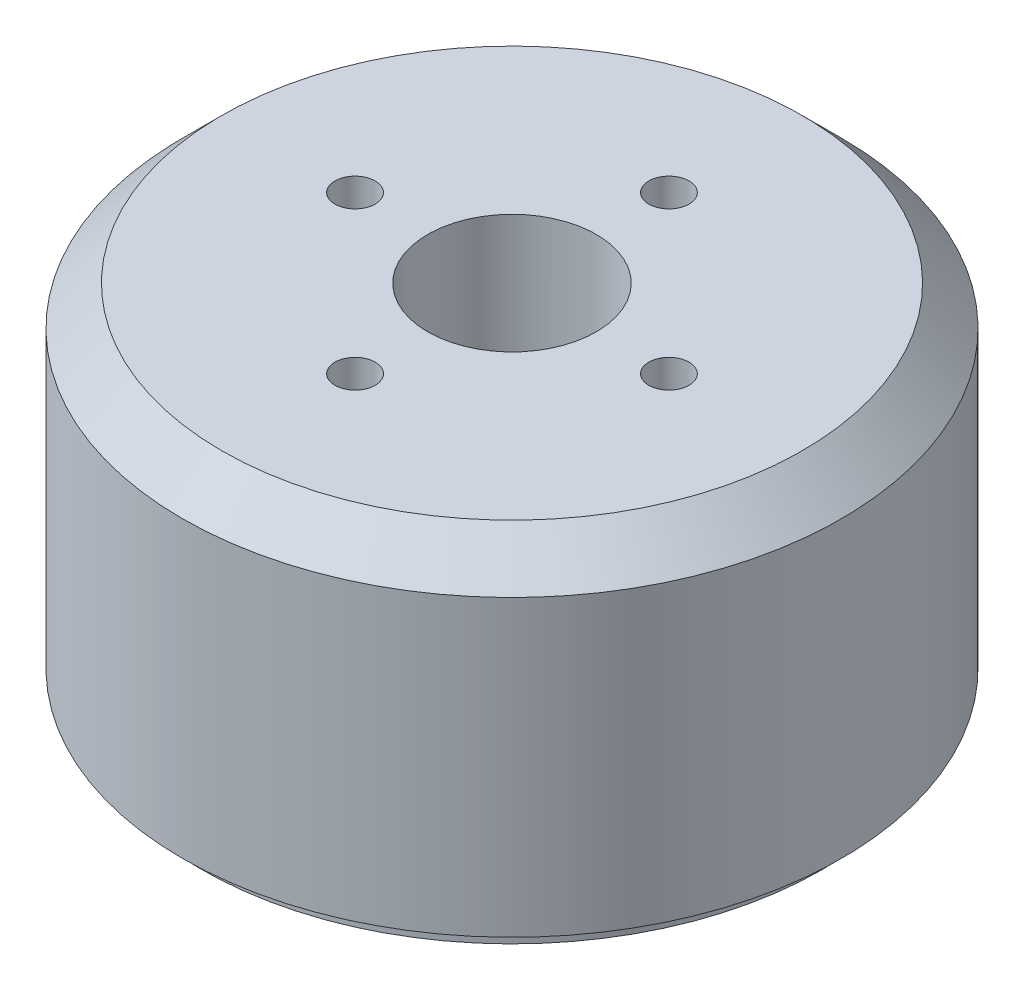
ISO-10303-21;
HEADER;
FILE_DESCRIPTION(('STEP AP214'),'2;1');
FILE_NAME('part.step','',(''),(''),'','','');
FILE_SCHEMA(('AUTOMOTIVE_DESIGN { 1 0 10303 214 1 1 1 1 }'));
ENDSEC;
DATA;
#1=APPLICATION_CONTEXT('core data for automotive mechanical design processes');
#2=APPLICATION_PROTOCOL_DEFINITION('international standard','automotive_design',2000,#1);
#3=PRODUCT_CONTEXT('',#1,'mechanical');
#4=PRODUCT('Part','Part','',(#3));
#5=PRODUCT_RELATED_PRODUCT_CATEGORY('part','',(#4));
#6=PRODUCT_DEFINITION_FORMATION('','',#4);
#7=PRODUCT_DEFINITION_CONTEXT('part definition',#1,'design');
#8=PRODUCT_DEFINITION('design','',#6,#7);
#9=PRODUCT_DEFINITION_SHAPE('','',#8);
#10=(LENGTH_UNIT() NAMED_UNIT(*) SI_UNIT(.MILLI.,.METRE.));
#11=(NAMED_UNIT(*) PLANE_ANGLE_UNIT() SI_UNIT($,.RADIAN.));
#12=(NAMED_UNIT(*) SI_UNIT($,.STERADIAN.) SOLID_ANGLE_UNIT());
#13=UNCERTAINTY_MEASURE_WITH_UNIT(LENGTH_MEASURE(1.E-05),#10,'distance_accuracy_value','');
#14=(GEOMETRIC_REPRESENTATION_CONTEXT(3) GLOBAL_UNCERTAINTY_ASSIGNED_CONTEXT((#13)) GLOBAL_UNIT_ASSIGNED_CONTEXT((#10,
#11,#12)) REPRESENTATION_CONTEXT('',''));
#15=CARTESIAN_POINT('',(0.,0.,0.));
#16=DIRECTION('',(0.,0.,1.));
#17=DIRECTION('',(1.,0.,0.));
#18=AXIS2_PLACEMENT_3D('',#15,#16,#17);
#19=CARTESIAN_POINT('',(0.,0.,0.));
#20=DIRECTION('',(0.,1.,0.));
#21=DIRECTION('',(0.,0.,1.));
#22=AXIS2_PLACEMENT_3D('',#19,#20,#21);
#23=PLANE('',#22);
#24=CARTESIAN_POINT('',(1.13871772702761E-13,0.,11.));
#25=DIRECTION('',(0.,-1.,0.));
#26=DIRECTION('',(0.,0.,-1.));
#27=AXIS2_PLACEMENT_3D('',#24,#25,#26);
#28=CIRCLE('',#27,1.025);
#29=CARTESIAN_POINT('',(1.13871772702761E-13,0.,9.975));
#30=VERTEX_POINT('',#29);
#31=EDGE_CURVE('E100',#30,#30,#28,.T.);
#32=ORIENTED_EDGE('',*,*,#31,.F.);
#33=EDGE_LOOP('',(#32));
#34=FACE_BOUND('',#33,.T.);
#35=CARTESIAN_POINT('',(-11.,0.,0.));
#36=DIRECTION('',(0.,-1.,0.));
#37=DIRECTION('',(0.,0.,-1.));
#38=AXIS2_PLACEMENT_3D('',#35,#36,#37);
#39=CIRCLE('',#38,1.025);
#40=CARTESIAN_POINT('',(-11.,0.,-1.025));
#41=VERTEX_POINT('',#40);
#42=EDGE_CURVE('E99',#41,#41,#39,.T.);
#43=ORIENTED_EDGE('',*,*,#42,.F.);
#44=EDGE_LOOP('',(#43));
#45=FACE_BOUND('',#44,.T.);
#46=CARTESIAN_POINT('',(0.,0.,-11.));
#47=DIRECTION('',(0.,-1.,0.));
#48=DIRECTION('',(0.,0.,-1.));
#49=AXIS2_PLACEMENT_3D('',#46,#47,#48);
#50=CIRCLE('',#49,1.025);
#51=CARTESIAN_POINT('',(0.,0.,-12.025));
#52=VERTEX_POINT('',#51);
#53=EDGE_CURVE('E110',#52,#52,#50,.T.);
#54=ORIENTED_EDGE('',*,*,#53,.F.);
#55=EDGE_LOOP('',(#54));
#56=FACE_BOUND('',#55,.T.);
#57=CARTESIAN_POINT('',(11.,0.,0.));
#58=DIRECTION('',(0.,-1.,0.));
#59=DIRECTION('',(0.,0.,-1.));
#60=AXIS2_PLACEMENT_3D('',#57,#58,#59);
#61=CIRCLE('',#60,1.025);
#62=CARTESIAN_POINT('',(11.,0.,-1.025));
#63=VERTEX_POINT('',#62);
#64=EDGE_CURVE('E116',#63,#63,#61,.T.);
#65=ORIENTED_EDGE('',*,*,#64,.F.);
#66=EDGE_LOOP('',(#65));
#67=FACE_BOUND('',#66,.T.);
#68=CARTESIAN_POINT('',(0.,0.,0.));
#69=DIRECTION('',(0.,1.,0.));
#70=DIRECTION('',(0.,0.,1.));
#71=AXIS2_PLACEMENT_3D('',#68,#69,#70);
#72=CIRCLE('',#71,5.3);
#73=CARTESIAN_POINT('',(0.,0.,5.3));
#74=VERTEX_POINT('',#73);
#75=EDGE_CURVE('E12',#74,#74,#72,.F.);
#76=ORIENTED_EDGE('',*,*,#75,.F.);
#77=EDGE_LOOP('',(#76));
#78=FACE_BOUND('',#77,.T.);
#79=CARTESIAN_POINT('',(0.,0.,0.));
#80=DIRECTION('',(0.,-1.,0.));
#81=DIRECTION('',(1.,0.,0.));
#82=AXIS2_PLACEMENT_3D('',#79,#80,#81);
#83=CIRCLE('',#82,15.8);
#84=CARTESIAN_POINT('',(15.8,0.,0.));
#85=VERTEX_POINT('',#84);
#86=EDGE_CURVE('E122',#85,#85,#83,.T.);
#87=ORIENTED_EDGE('',*,*,#86,.T.);
#88=EDGE_LOOP('',(#87));
#89=FACE_BOUND('',#88,.T.);
#90=ADVANCED_FACE('F56',(#34,#45,#56,#67,#78,#89),#23,.F.);
#91=CARTESIAN_POINT('',(0.,18.,0.));
#92=DIRECTION('',(0.,-1.,0.));
#93=DIRECTION('',(0.,0.,-1.));
#94=AXIS2_PLACEMENT_3D('',#91,#92,#93);
#95=CYLINDRICAL_SURFACE('',#94,16.8);
#96=CARTESIAN_POINT('',(0.,16.,0.));
#97=DIRECTION('',(0.,1.,0.));
#98=DIRECTION('',(0.,0.,1.));
#99=AXIS2_PLACEMENT_3D('',#96,#97,#98);
#100=CIRCLE('',#99,16.8);
#101=CARTESIAN_POINT('',(0.,16.,16.8));
#102=VERTEX_POINT('',#101);
#103=EDGE_CURVE('E64',#102,#102,#100,.F.);
#104=ORIENTED_EDGE('',*,*,#103,.T.);
#105=EDGE_LOOP('',(#104));
#106=FACE_BOUND('',#105,.T.);
#107=CARTESIAN_POINT('',(0.,1.,0.));
#108=DIRECTION('',(0.,-1.,0.));
#109=DIRECTION('',(0.,0.,-1.));
#110=AXIS2_PLACEMENT_3D('',#107,#108,#109);
#111=CIRCLE('',#110,16.8);
#112=CARTESIAN_POINT('',(0.,1.,-16.8));
#113=VERTEX_POINT('',#112);
#114=EDGE_CURVE('E126',#113,#113,#111,.T.);
#115=ORIENTED_EDGE('',*,*,#114,.F.);
#116=EDGE_LOOP('',(#115));
#117=FACE_BOUND('',#116,.T.);
#118=ADVANCED_FACE('F175',(#106,#117),#95,.T.);
#119=CARTESIAN_POINT('',(0.,-2.,0.));
#120=DIRECTION('',(0.,-1.,0.));
#121=DIRECTION('',(0.,0.,-1.));
#122=AXIS2_PLACEMENT_3D('',#119,#120,#121);
#123=PLANE('',#122);
#124=CARTESIAN_POINT('',(0.,-2.,0.));
#125=DIRECTION('',(0.,-1.,0.));
#126=DIRECTION('',(0.,0.,-1.));
#127=AXIS2_PLACEMENT_3D('',#124,#125,#126);
#128=CIRCLE('',#127,4.3);
#129=CARTESIAN_POINT('',(0.,-2.,-4.3));
#130=VERTEX_POINT('',#129);
#131=EDGE_CURVE('E140',#130,#130,#128,.T.);
#132=ORIENTED_EDGE('',*,*,#131,.F.);
#133=EDGE_LOOP('',(#132));
#134=FACE_BOUND('',#133,.T.);
#135=CARTESIAN_POINT('',(0.,-2.,0.));
#136=DIRECTION('',(0.,-1.,0.));
#137=DIRECTION('',(1.,0.,0.));
#138=AXIS2_PLACEMENT_3D('',#135,#136,#137);
#139=CIRCLE('',#138,4.8);
#140=CARTESIAN_POINT('',(4.8,-2.,0.));
#141=VERTEX_POINT('',#140);
#142=EDGE_CURVE('E131',#141,#141,#139,.T.);
#143=ORIENTED_EDGE('',*,*,#142,.T.);
#144=EDGE_LOOP('',(#143));
#145=FACE_BOUND('',#144,.T.);
#146=ADVANCED_FACE('F197',(#134,#145),#123,.T.);
#147=CARTESIAN_POINT('',(0.,-2.,0.));
#148=DIRECTION('',(0.,1.,0.));
#149=DIRECTION('',(0.,0.,1.));
#150=AXIS2_PLACEMENT_3D('',#147,#148,#149);
#151=CYLINDRICAL_SURFACE('',#150,5.3);
#152=ORIENTED_EDGE('',*,*,#75,.T.);
#153=EDGE_LOOP('',(#152));
#154=FACE_BOUND('',#153,.T.);
#155=CARTESIAN_POINT('',(0.,-1.5,0.));
#156=DIRECTION('',(0.,-1.,0.));
#157=DIRECTION('',(0.,0.,-1.));
#158=AXIS2_PLACEMENT_3D('',#155,#156,#157);
#159=CIRCLE('',#158,5.3);
#160=CARTESIAN_POINT('',(0.,-1.5,-5.3));
#161=VERTEX_POINT('',#160);
#162=EDGE_CURVE('E135',#161,#161,#159,.T.);
#163=ORIENTED_EDGE('',*,*,#162,.F.);
#164=EDGE_LOOP('',(#163));
#165=FACE_BOUND('',#164,.T.);
#166=ADVANCED_FACE('F187',(#154,#165),#151,.T.);
#167=CARTESIAN_POINT('',(0.,18.,0.));
#168=DIRECTION('',(0.,1.,0.));
#169=DIRECTION('',(0.,0.,1.));
#170=AXIS2_PLACEMENT_3D('',#167,#168,#169);
#171=PLANE('',#170);
#172=CARTESIAN_POINT('',(8.,18.,0.));
#173=DIRECTION('',(0.,1.,0.));
#174=DIRECTION('',(0.,0.,1.));
#175=AXIS2_PLACEMENT_3D('',#172,#173,#174);
#176=CIRCLE('',#175,1.025);
#177=CARTESIAN_POINT('',(8.,18.,1.02499999999992));
#178=VERTEX_POINT('',#177);
#179=EDGE_CURVE('E143',#178,#178,#176,.T.);
#180=ORIENTED_EDGE('',*,*,#179,.F.);
#181=EDGE_LOOP('',(#180));
#182=FACE_BOUND('',#181,.T.);
#183=CARTESIAN_POINT('',(0.,18.,8.));
#184=DIRECTION('',(0.,1.,0.));
#185=DIRECTION('',(0.,0.,1.));
#186=AXIS2_PLACEMENT_3D('',#183,#184,#185);
#187=CIRCLE('',#186,1.025);
#188=CARTESIAN_POINT('',(0.,18.,9.025));
#189=VERTEX_POINT('',#188);
#190=EDGE_CURVE('E149',#189,#189,#187,.T.);
#191=ORIENTED_EDGE('',*,*,#190,.F.);
#192=EDGE_LOOP('',(#191));
#193=FACE_BOUND('',#192,.T.);
#194=CARTESIAN_POINT('',(-8.,18.,0.));
#195=DIRECTION('',(0.,1.,0.));
#196=DIRECTION('',(0.,0.,1.));
#197=AXIS2_PLACEMENT_3D('',#194,#195,#196);
#198=CIRCLE('',#197,1.025);
#199=CARTESIAN_POINT('',(-8.,18.,1.02500000000003));
#200=VERTEX_POINT('',#199);
#201=EDGE_CURVE('E155',#200,#200,#198,.T.);
#202=ORIENTED_EDGE('',*,*,#201,.F.);
#203=EDGE_LOOP('',(#202));
#204=FACE_BOUND('',#203,.T.);
#205=CARTESIAN_POINT('',(0.,18.,-8.));
#206=DIRECTION('',(0.,1.,0.));
#207=DIRECTION('',(0.,0.,1.));
#208=AXIS2_PLACEMENT_3D('',#205,#206,#207);
#209=CIRCLE('',#208,1.025);
#210=CARTESIAN_POINT('',(0.,18.,-6.975));
#211=VERTEX_POINT('',#210);
#212=EDGE_CURVE('E161',#211,#211,#209,.T.);
#213=ORIENTED_EDGE('',*,*,#212,.F.);
#214=EDGE_LOOP('',(#213));
#215=FACE_BOUND('',#214,.T.);
#216=CARTESIAN_POINT('',(0.,18.,0.));
#217=DIRECTION('',(0.,1.,0.));
#218=DIRECTION('',(0.,0.,1.));
#219=AXIS2_PLACEMENT_3D('',#216,#217,#218);
#220=CIRCLE('',#219,14.8);
#221=CARTESIAN_POINT('',(0.,18.,14.8));
#222=VERTEX_POINT('',#221);
#223=EDGE_CURVE('E170',#222,#222,#220,.T.);
#224=ORIENTED_EDGE('',*,*,#223,.T.);
#225=EDGE_LOOP('',(#224));
#226=FACE_BOUND('',#225,.T.);
#227=CARTESIAN_POINT('',(0.,18.,0.));
#228=DIRECTION('',(0.,1.,0.));
#229=DIRECTION('',(0.,0.,1.));
#230=AXIS2_PLACEMENT_3D('',#227,#228,#229);
#231=CIRCLE('',#230,4.3);
#232=CARTESIAN_POINT('',(0.,18.,4.3));
#233=VERTEX_POINT('',#232);
#234=EDGE_CURVE('E167',#233,#233,#231,.T.);
#235=ORIENTED_EDGE('',*,*,#234,.F.);
#236=EDGE_LOOP('',(#235));
#237=FACE_BOUND('',#236,.T.);
#238=ADVANCED_FACE('F184',(#182,#193,#204,#215,#226,#237),#171,.T.);
#239=CARTESIAN_POINT('',(0.,0.,0.));
#240=DIRECTION('',(0.,1.,0.));
#241=DIRECTION('',(0.,0.,1.));
#242=AXIS2_PLACEMENT_3D('',#239,#240,#241);
#243=CYLINDRICAL_SURFACE('',#242,4.3);
#244=ORIENTED_EDGE('',*,*,#234,.T.);
#245=EDGE_LOOP('',(#244));
#246=FACE_BOUND('',#245,.T.);
#247=ORIENTED_EDGE('',*,*,#131,.T.);
#248=EDGE_LOOP('',(#247));
#249=FACE_BOUND('',#248,.T.);
#250=ADVANCED_FACE('F181',(#246,#249),#243,.F.);
#251=CARTESIAN_POINT('',(0.,18.,0.));
#252=DIRECTION('',(0.,-1.,0.));
#253=DIRECTION('',(0.,0.,-1.));
#254=AXIS2_PLACEMENT_3D('',#251,#252,#253);
#255=CONICAL_SURFACE('',#254,14.8,0.785398163397446);
#256=ORIENTED_EDGE('',*,*,#103,.F.);
#257=EDGE_LOOP('',(#256));
#258=FACE_BOUND('',#257,.T.);
#259=ORIENTED_EDGE('',*,*,#223,.F.);
#260=EDGE_LOOP('',(#259));
#261=FACE_BOUND('',#260,.T.);
#262=ADVANCED_FACE('F58',(#258,#261),#255,.T.);
#263=CARTESIAN_POINT('',(0.,14.,-8.));
#264=DIRECTION('',(0.,1.,0.));
#265=DIRECTION('',(0.,0.,1.));
#266=AXIS2_PLACEMENT_3D('',#263,#264,#265);
#267=CONICAL_SURFACE('',#266,1.025,1.02974425867665);
#268=CARTESIAN_POINT('',(0.,13.3841178654967,-8.));
#269=VERTEX_POINT('',#268);
#270=VERTEX_LOOP('',#269);
#271=FACE_BOUND('',#270,.T.);
#272=CARTESIAN_POINT('',(0.,14.,-8.));
#273=DIRECTION('',(0.,1.,0.));
#274=DIRECTION('',(0.,0.,1.));
#275=AXIS2_PLACEMENT_3D('',#272,#273,#274);
#276=CIRCLE('',#275,1.025);
#277=CARTESIAN_POINT('',(0.,14.,-6.975));
#278=VERTEX_POINT('',#277);
#279=EDGE_CURVE('E164',#278,#278,#276,.T.);
#280=ORIENTED_EDGE('',*,*,#279,.T.);
#281=EDGE_LOOP('',(#280));
#282=FACE_BOUND('',#281,.T.);
#283=ADVANCED_FACE('F180',(#271,#282),#267,.F.);
#284=CARTESIAN_POINT('',(0.,18.,-8.));
#285=DIRECTION('',(0.,1.,0.));
#286=DIRECTION('',(0.,0.,1.));
#287=AXIS2_PLACEMENT_3D('',#284,#285,#286);
#288=CYLINDRICAL_SURFACE('',#287,1.025);
#289=ORIENTED_EDGE('',*,*,#279,.F.);
#290=EDGE_LOOP('',(#289));
#291=FACE_BOUND('',#290,.T.);
#292=ORIENTED_EDGE('',*,*,#212,.T.);
#293=EDGE_LOOP('',(#292));
#294=FACE_BOUND('',#293,.T.);
#295=ADVANCED_FACE('F230',(#291,#294),#288,.F.);
#296=CARTESIAN_POINT('',(-8.,14.,0.));
#297=DIRECTION('',(0.,1.,0.));
#298=DIRECTION('',(0.,0.,1.));
#299=AXIS2_PLACEMENT_3D('',#296,#297,#298);
#300=CONICAL_SURFACE('',#299,1.025,1.02974425867665);
#301=CARTESIAN_POINT('',(-8.,13.3841178654967,0.));
#302=VERTEX_POINT('',#301);
#303=VERTEX_LOOP('',#302);
#304=FACE_BOUND('',#303,.T.);
#305=CARTESIAN_POINT('',(-8.,14.,0.));
#306=DIRECTION('',(0.,1.,0.));
#307=DIRECTION('',(0.,0.,1.));
#308=AXIS2_PLACEMENT_3D('',#305,#306,#307);
#309=CIRCLE('',#308,1.025);
#310=CARTESIAN_POINT('',(-8.,14.,1.02500000000003));
#311=VERTEX_POINT('',#310);
#312=EDGE_CURVE('E158',#311,#311,#309,.T.);
#313=ORIENTED_EDGE('',*,*,#312,.T.);
#314=EDGE_LOOP('',(#313));
#315=FACE_BOUND('',#314,.T.);
#316=ADVANCED_FACE('F233',(#304,#315),#300,.F.);
#317=CARTESIAN_POINT('',(-8.,18.,0.));
#318=DIRECTION('',(0.,1.,0.));
#319=DIRECTION('',(0.,0.,1.));
#320=AXIS2_PLACEMENT_3D('',#317,#318,#319);
#321=CYLINDRICAL_SURFACE('',#320,1.025);
#322=ORIENTED_EDGE('',*,*,#312,.F.);
#323=EDGE_LOOP('',(#322));
#324=FACE_BOUND('',#323,.T.);
#325=ORIENTED_EDGE('',*,*,#201,.T.);
#326=EDGE_LOOP('',(#325));
#327=FACE_BOUND('',#326,.T.);
#328=ADVANCED_FACE('F237',(#324,#327),#321,.F.);
#329=CARTESIAN_POINT('',(0.,14.,8.));
#330=DIRECTION('',(0.,1.,0.));
#331=DIRECTION('',(0.,0.,1.));
#332=AXIS2_PLACEMENT_3D('',#329,#330,#331);
#333=CONICAL_SURFACE('',#332,1.025,1.02974425867665);
#334=CARTESIAN_POINT('',(0.,13.3841178654967,8.));
#335=VERTEX_POINT('',#334);
#336=VERTEX_LOOP('',#335);
#337=FACE_BOUND('',#336,.T.);
#338=CARTESIAN_POINT('',(0.,14.,8.));
#339=DIRECTION('',(0.,1.,0.));
#340=DIRECTION('',(0.,0.,1.));
#341=AXIS2_PLACEMENT_3D('',#338,#339,#340);
#342=CIRCLE('',#341,1.025);
#343=CARTESIAN_POINT('',(0.,14.,9.025));
#344=VERTEX_POINT('',#343);
#345=EDGE_CURVE('E152',#344,#344,#342,.T.);
#346=ORIENTED_EDGE('',*,*,#345,.T.);
#347=EDGE_LOOP('',(#346));
#348=FACE_BOUND('',#347,.T.);
#349=ADVANCED_FACE('F240',(#337,#348),#333,.F.);
#350=CARTESIAN_POINT('',(0.,18.,8.));
#351=DIRECTION('',(0.,1.,0.));
#352=DIRECTION('',(0.,0.,1.));
#353=AXIS2_PLACEMENT_3D('',#350,#351,#352);
#354=CYLINDRICAL_SURFACE('',#353,1.025);
#355=ORIENTED_EDGE('',*,*,#345,.F.);
#356=EDGE_LOOP('',(#355));
#357=FACE_BOUND('',#356,.T.);
#358=ORIENTED_EDGE('',*,*,#190,.T.);
#359=EDGE_LOOP('',(#358));
#360=FACE_BOUND('',#359,.T.);
#361=ADVANCED_FACE('F244',(#357,#360),#354,.F.);
#362=CARTESIAN_POINT('',(8.,14.,0.));
#363=DIRECTION('',(0.,1.,0.));
#364=DIRECTION('',(0.,0.,1.));
#365=AXIS2_PLACEMENT_3D('',#362,#363,#364);
#366=CONICAL_SURFACE('',#365,1.025,1.02974425867665);
#367=CARTESIAN_POINT('',(8.,13.3841178654967,0.));
#368=VERTEX_POINT('',#367);
#369=VERTEX_LOOP('',#368);
#370=FACE_BOUND('',#369,.T.);
#371=CARTESIAN_POINT('',(8.,14.,0.));
#372=DIRECTION('',(0.,1.,0.));
#373=DIRECTION('',(0.,0.,1.));
#374=AXIS2_PLACEMENT_3D('',#371,#372,#373);
#375=CIRCLE('',#374,1.025);
#376=CARTESIAN_POINT('',(8.,14.,1.02499999999991));
#377=VERTEX_POINT('',#376);
#378=EDGE_CURVE('E146',#377,#377,#375,.T.);
#379=ORIENTED_EDGE('',*,*,#378,.T.);
#380=EDGE_LOOP('',(#379));
#381=FACE_BOUND('',#380,.T.);
#382=ADVANCED_FACE('F248',(#370,#381),#366,.F.);
#383=CARTESIAN_POINT('',(8.,18.,0.));
#384=DIRECTION('',(0.,1.,0.));
#385=DIRECTION('',(0.,0.,1.));
#386=AXIS2_PLACEMENT_3D('',#383,#384,#385);
#387=CYLINDRICAL_SURFACE('',#386,1.025);
#388=ORIENTED_EDGE('',*,*,#378,.F.);
#389=EDGE_LOOP('',(#388));
#390=FACE_BOUND('',#389,.T.);
#391=ORIENTED_EDGE('',*,*,#179,.T.);
#392=EDGE_LOOP('',(#391));
#393=FACE_BOUND('',#392,.T.);
#394=ADVANCED_FACE('F216',(#390,#393),#387,.F.);
#395=CARTESIAN_POINT('',(0.,-1.5,0.));
#396=DIRECTION('',(0.,-1.,0.));
#397=DIRECTION('',(0.,0.,-1.));
#398=AXIS2_PLACEMENT_3D('',#395,#396,#397);
#399=PLANE('',#398);
#400=CARTESIAN_POINT('',(0.,-1.5,0.));
#401=DIRECTION('',(0.,-1.,0.));
#402=DIRECTION('',(1.,0.,0.));
#403=AXIS2_PLACEMENT_3D('',#400,#401,#402);
#404=CIRCLE('',#403,4.8);
#405=CARTESIAN_POINT('',(4.8,-1.5,0.));
#406=VERTEX_POINT('',#405);
#407=EDGE_CURVE('E132',#406,#406,#404,.T.);
#408=ORIENTED_EDGE('',*,*,#407,.F.);
#409=EDGE_LOOP('',(#408));
#410=FACE_BOUND('',#409,.T.);
#411=ORIENTED_EDGE('',*,*,#162,.T.);
#412=EDGE_LOOP('',(#411));
#413=FACE_BOUND('',#412,.T.);
#414=ADVANCED_FACE('F206',(#410,#413),#399,.T.);
#415=CARTESIAN_POINT('',(0.,-1.5,0.));
#416=DIRECTION('',(0.,-1.,0.));
#417=DIRECTION('',(0.,0.,-1.));
#418=AXIS2_PLACEMENT_3D('',#415,#416,#417);
#419=CYLINDRICAL_SURFACE('',#418,4.8);
#420=ORIENTED_EDGE('',*,*,#407,.T.);
#421=EDGE_LOOP('',(#420));
#422=FACE_BOUND('',#421,.T.);
#423=ORIENTED_EDGE('',*,*,#142,.F.);
#424=EDGE_LOOP('',(#423));
#425=FACE_BOUND('',#424,.T.);
#426=ADVANCED_FACE('F203',(#422,#425),#419,.T.);
#427=CARTESIAN_POINT('',(0.,1.,0.));
#428=DIRECTION('',(0.,-1.,0.));
#429=DIRECTION('',(0.,0.,-1.));
#430=AXIS2_PLACEMENT_3D('',#427,#428,#429);
#431=PLANE('',#430);
#432=CARTESIAN_POINT('',(0.,1.,0.));
#433=DIRECTION('',(0.,-1.,0.));
#434=DIRECTION('',(1.,0.,0.));
#435=AXIS2_PLACEMENT_3D('',#432,#433,#434);
#436=CIRCLE('',#435,15.8);
#437=CARTESIAN_POINT('',(15.8,1.,0.));
#438=VERTEX_POINT('',#437);
#439=EDGE_CURVE('E123',#438,#438,#436,.T.);
#440=ORIENTED_EDGE('',*,*,#439,.F.);
#441=EDGE_LOOP('',(#440));
#442=FACE_BOUND('',#441,.T.);
#443=ORIENTED_EDGE('',*,*,#114,.T.);
#444=EDGE_LOOP('',(#443));
#445=FACE_BOUND('',#444,.T.);
#446=ADVANCED_FACE('F205',(#442,#445),#431,.T.);
#447=CARTESIAN_POINT('',(0.,1.,0.));
#448=DIRECTION('',(0.,-1.,0.));
#449=DIRECTION('',(0.,0.,-1.));
#450=AXIS2_PLACEMENT_3D('',#447,#448,#449);
#451=CYLINDRICAL_SURFACE('',#450,15.8);
#452=ORIENTED_EDGE('',*,*,#439,.T.);
#453=EDGE_LOOP('',(#452));
#454=FACE_BOUND('',#453,.T.);
#455=ORIENTED_EDGE('',*,*,#86,.F.);
#456=EDGE_LOOP('',(#455));
#457=FACE_BOUND('',#456,.T.);
#458=ADVANCED_FACE('F213',(#454,#457),#451,.T.);
#459=CARTESIAN_POINT('',(11.,4.,0.));
#460=DIRECTION('',(0.,-1.,0.));
#461=DIRECTION('',(0.,0.,-1.));
#462=AXIS2_PLACEMENT_3D('',#459,#460,#461);
#463=CONICAL_SURFACE('',#462,1.025,1.02974425867665);
#464=CARTESIAN_POINT('',(11.,4.61588213450325,0.));
#465=VERTEX_POINT('',#464);
#466=VERTEX_LOOP('',#465);
#467=FACE_BOUND('',#466,.T.);
#468=CARTESIAN_POINT('',(11.,4.,0.));
#469=DIRECTION('',(0.,-1.,0.));
#470=DIRECTION('',(0.,0.,-1.));
#471=AXIS2_PLACEMENT_3D('',#468,#469,#470);
#472=CIRCLE('',#471,1.025);
#473=CARTESIAN_POINT('',(11.,4.,-1.025));
#474=VERTEX_POINT('',#473);
#475=EDGE_CURVE('E119',#474,#474,#472,.T.);
#476=ORIENTED_EDGE('',*,*,#475,.T.);
#477=EDGE_LOOP('',(#476));
#478=FACE_BOUND('',#477,.T.);
#479=ADVANCED_FACE('F269',(#467,#478),#463,.F.);
#480=CARTESIAN_POINT('',(11.,0.,0.));
#481=DIRECTION('',(0.,-1.,0.));
#482=DIRECTION('',(0.,0.,-1.));
#483=AXIS2_PLACEMENT_3D('',#480,#481,#482);
#484=CYLINDRICAL_SURFACE('',#483,1.025);
#485=ORIENTED_EDGE('',*,*,#475,.F.);
#486=EDGE_LOOP('',(#485));
#487=FACE_BOUND('',#486,.T.);
#488=ORIENTED_EDGE('',*,*,#64,.T.);
#489=EDGE_LOOP('',(#488));
#490=FACE_BOUND('',#489,.T.);
#491=ADVANCED_FACE('F275',(#487,#490),#484,.F.);
#492=CARTESIAN_POINT('',(0.,4.,-11.));
#493=DIRECTION('',(0.,-1.,0.));
#494=DIRECTION('',(0.,0.,-1.));
#495=AXIS2_PLACEMENT_3D('',#492,#493,#494);
#496=CONICAL_SURFACE('',#495,1.025,1.02974425867665);
#497=CARTESIAN_POINT('',(0.,4.61588213450325,-11.));
#498=VERTEX_POINT('',#497);
#499=VERTEX_LOOP('',#498);
#500=FACE_BOUND('',#499,.T.);
#501=CARTESIAN_POINT('',(0.,4.,-11.));
#502=DIRECTION('',(0.,-1.,0.));
#503=DIRECTION('',(0.,0.,-1.));
#504=AXIS2_PLACEMENT_3D('',#501,#502,#503);
#505=CIRCLE('',#504,1.025);
#506=CARTESIAN_POINT('',(0.,4.,-12.025));
#507=VERTEX_POINT('',#506);
#508=EDGE_CURVE('E113',#507,#507,#505,.T.);
#509=ORIENTED_EDGE('',*,*,#508,.T.);
#510=EDGE_LOOP('',(#509));
#511=FACE_BOUND('',#510,.T.);
#512=ADVANCED_FACE('F281',(#500,#511),#496,.F.);
#513=CARTESIAN_POINT('',(0.,0.,-11.));
#514=DIRECTION('',(0.,-1.,0.));
#515=DIRECTION('',(0.,0.,-1.));
#516=AXIS2_PLACEMENT_3D('',#513,#514,#515);
#517=CYLINDRICAL_SURFACE('',#516,1.025);
#518=ORIENTED_EDGE('',*,*,#508,.F.);
#519=EDGE_LOOP('',(#518));
#520=FACE_BOUND('',#519,.T.);
#521=ORIENTED_EDGE('',*,*,#53,.T.);
#522=EDGE_LOOP('',(#521));
#523=FACE_BOUND('',#522,.T.);
#524=ADVANCED_FACE('F285',(#520,#523),#517,.F.);
#525=CARTESIAN_POINT('',(-11.,4.,0.));
#526=DIRECTION('',(0.,-1.,0.));
#527=DIRECTION('',(0.,0.,-1.));
#528=AXIS2_PLACEMENT_3D('',#525,#526,#527);
#529=CONICAL_SURFACE('',#528,1.025,1.02974425867665);
#530=CARTESIAN_POINT('',(-11.,4.61588213450325,0.));
#531=VERTEX_POINT('',#530);
#532=VERTEX_LOOP('',#531);
#533=FACE_BOUND('',#532,.T.);
#534=CARTESIAN_POINT('',(-11.,4.,0.));
#535=DIRECTION('',(0.,-1.,0.));
#536=DIRECTION('',(0.,0.,-1.));
#537=AXIS2_PLACEMENT_3D('',#534,#535,#536);
#538=CIRCLE('',#537,1.025);
#539=CARTESIAN_POINT('',(-11.,4.,-1.025));
#540=VERTEX_POINT('',#539);
#541=EDGE_CURVE('E103',#540,#540,#538,.T.);
#542=ORIENTED_EDGE('',*,*,#541,.T.);
#543=EDGE_LOOP('',(#542));
#544=FACE_BOUND('',#543,.T.);
#545=ADVANCED_FACE('F289',(#533,#544),#529,.F.);
#546=CARTESIAN_POINT('',(-11.,0.,0.));
#547=DIRECTION('',(0.,-1.,0.));
#548=DIRECTION('',(0.,0.,-1.));
#549=AXIS2_PLACEMENT_3D('',#546,#547,#548);
#550=CYLINDRICAL_SURFACE('',#549,1.025);
#551=ORIENTED_EDGE('',*,*,#541,.F.);
#552=EDGE_LOOP('',(#551));
#553=FACE_BOUND('',#552,.T.);
#554=ORIENTED_EDGE('',*,*,#42,.T.);
#555=EDGE_LOOP('',(#554));
#556=FACE_BOUND('',#555,.T.);
#557=ADVANCED_FACE('F93',(#553,#556),#550,.F.);
#558=CARTESIAN_POINT('',(1.13871772702761E-13,4.,11.));
#559=DIRECTION('',(0.,-1.,0.));
#560=DIRECTION('',(0.,0.,-1.));
#561=AXIS2_PLACEMENT_3D('',#558,#559,#560);
#562=CONICAL_SURFACE('',#561,1.025,1.02974425867665);
#563=CARTESIAN_POINT('',(1.12750781423973E-13,4.61588213450325,11.));
#564=VERTEX_POINT('',#563);
#565=VERTEX_LOOP('',#564);
#566=FACE_BOUND('',#565,.T.);
#567=CARTESIAN_POINT('',(1.13871772702761E-13,4.,11.));
#568=DIRECTION('',(0.,-1.,0.));
#569=DIRECTION('',(0.,0.,-1.));
#570=AXIS2_PLACEMENT_3D('',#567,#568,#569);
#571=CIRCLE('',#570,1.025);
#572=CARTESIAN_POINT('',(1.13871772702761E-13,4.,9.975));
#573=VERTEX_POINT('',#572);
#574=EDGE_CURVE('E97',#573,#573,#571,.T.);
#575=ORIENTED_EDGE('',*,*,#574,.T.);
#576=EDGE_LOOP('',(#575));
#577=FACE_BOUND('',#576,.T.);
#578=ADVANCED_FACE('F89',(#566,#577),#562,.F.);
#579=CARTESIAN_POINT('',(1.13871772702761E-13,0.,11.));
#580=DIRECTION('',(0.,-1.,0.));
#581=DIRECTION('',(0.,0.,-1.));
#582=AXIS2_PLACEMENT_3D('',#579,#580,#581);
#583=CYLINDRICAL_SURFACE('',#582,1.025);
#584=ORIENTED_EDGE('',*,*,#574,.F.);
#585=EDGE_LOOP('',(#584));
#586=FACE_BOUND('',#585,.T.);
#587=ORIENTED_EDGE('',*,*,#31,.T.);
#588=EDGE_LOOP('',(#587));
#589=FACE_BOUND('',#588,.T.);
#590=ADVANCED_FACE('F92',(#586,#589),#583,.F.);
#591=CLOSED_SHELL('',(#90,#118,#146,#166,#238,#250,#262,#283,#295,#316,#328,#349,#361,#382,#394,
#414,#426,#446,#458,#479,#491,#512,#524,#545,#557,#578,#590));
#592=MANIFOLD_SOLID_BREP('B2',#591);
#593=ADVANCED_BREP_SHAPE_REPRESENTATION('',(#18,#592),#14);
#594=SHAPE_DEFINITION_REPRESENTATION(#9,#593);
ENDSEC;
END-ISO-10303-21;
